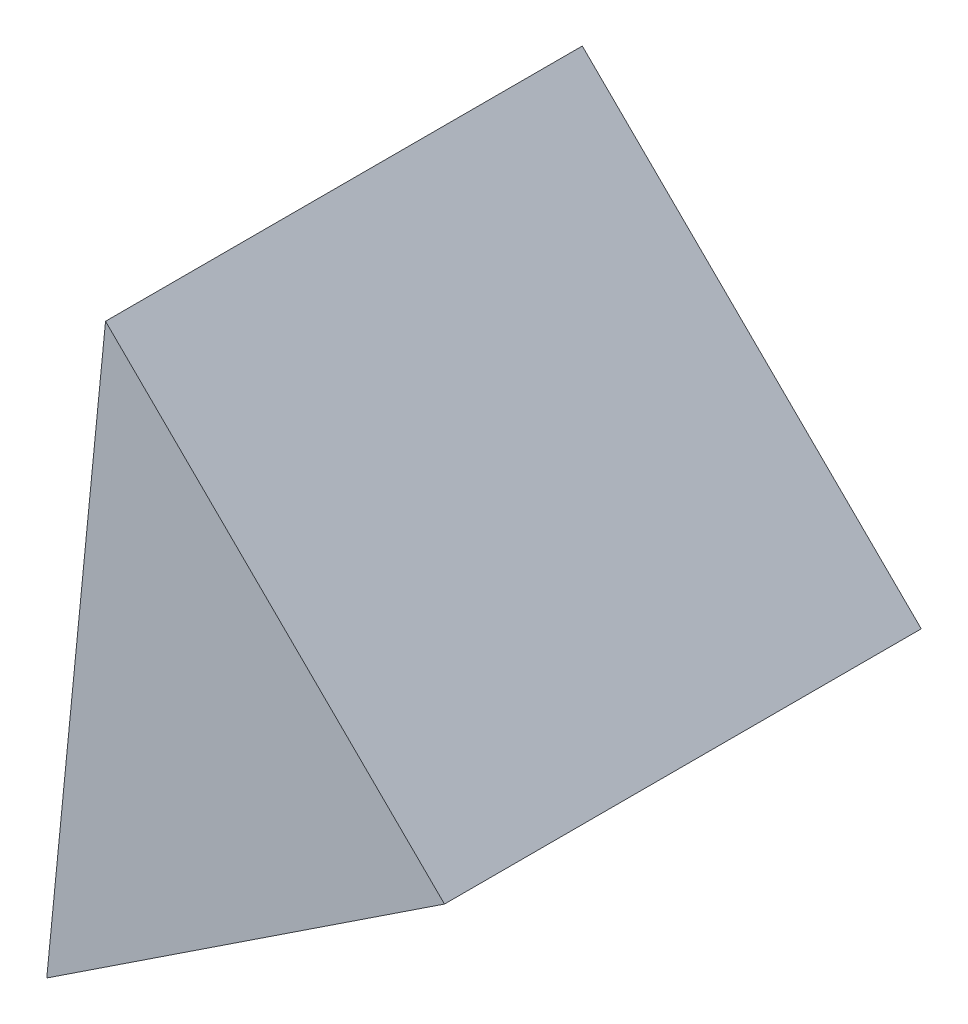
ISO-10303-21;
HEADER;
FILE_DESCRIPTION(('STEP AP214'),'2;1');
FILE_NAME('part.step','',(''),(''),'','','');
FILE_SCHEMA(('AUTOMOTIVE_DESIGN { 1 0 10303 214 1 1 1 1 }'));
ENDSEC;
DATA;
#1=APPLICATION_CONTEXT('core data for automotive mechanical design processes');
#2=APPLICATION_PROTOCOL_DEFINITION('international standard','automotive_design',2000,#1);
#3=PRODUCT_CONTEXT('',#1,'mechanical');
#4=PRODUCT('Part','Part','',(#3));
#5=PRODUCT_RELATED_PRODUCT_CATEGORY('part','',(#4));
#6=PRODUCT_DEFINITION_FORMATION('','',#4);
#7=PRODUCT_DEFINITION_CONTEXT('part definition',#1,'design');
#8=PRODUCT_DEFINITION('design','',#6,#7);
#9=PRODUCT_DEFINITION_SHAPE('','',#8);
#10=(LENGTH_UNIT() NAMED_UNIT(*) SI_UNIT(.MILLI.,.METRE.));
#11=(NAMED_UNIT(*) PLANE_ANGLE_UNIT() SI_UNIT($,.RADIAN.));
#12=(NAMED_UNIT(*) SI_UNIT($,.STERADIAN.) SOLID_ANGLE_UNIT());
#13=UNCERTAINTY_MEASURE_WITH_UNIT(LENGTH_MEASURE(1.E-05),#10,'distance_accuracy_value','');
#14=(GEOMETRIC_REPRESENTATION_CONTEXT(3) GLOBAL_UNCERTAINTY_ASSIGNED_CONTEXT((#13)) GLOBAL_UNIT_ASSIGNED_CONTEXT((#10,
#11,#12)) REPRESENTATION_CONTEXT('',''));
#15=CARTESIAN_POINT('',(0.,0.,0.));
#16=DIRECTION('',(0.,0.,1.));
#17=DIRECTION('',(1.,0.,0.));
#18=AXIS2_PLACEMENT_3D('',#15,#16,#17);
#19=CARTESIAN_POINT('',(9.0285708516963,6.36148636505805,10.));
#20=DIRECTION('',(-0.551401526003401,0.834239987726026,0.));
#21=DIRECTION('',(-0.834239987726026,-0.551401526003401,0.));
#22=AXIS2_PLACEMENT_3D('',#19,#20,#21);
#23=PLANE('',#22);
#24=DIRECTION('',(0.834239987726026,0.551401526003401,0.));
#25=VECTOR('',#24,1.);
#26=CARTESIAN_POINT('',(9.0285708516963,6.36148636505805,0.));
#27=LINE('',#26,#25);
#28=CARTESIAN_POINT('',(0.686170974436035,0.847471105024041,0.));
#29=VERTEX_POINT('',#28);
#30=CARTESIAN_POINT('',(9.0285708516963,6.36148636505805,0.));
#31=VERTEX_POINT('',#30);
#32=EDGE_CURVE('E82',#29,#31,#27,.T.);
#33=ORIENTED_EDGE('',*,*,#32,.T.);
#34=DIRECTION('',(0.,0.,-1.));
#35=VECTOR('',#34,1.);
#36=CARTESIAN_POINT('',(9.0285708516963,6.36148636505805,10.));
#37=LINE('',#36,#35);
#38=CARTESIAN_POINT('',(9.0285708516963,6.36148636505805,10.));
#39=VERTEX_POINT('',#38);
#40=EDGE_CURVE('E11',#39,#31,#37,.T.);
#41=ORIENTED_EDGE('',*,*,#40,.F.);
#42=DIRECTION('',(0.834239987726026,0.551401526003401,0.));
#43=VECTOR('',#42,1.);
#44=CARTESIAN_POINT('',(9.0285708516963,6.36148636505805,10.));
#45=LINE('',#44,#43);
#46=CARTESIAN_POINT('',(0.686170974436035,0.847471105024041,10.));
#47=VERTEX_POINT('',#46);
#48=EDGE_CURVE('E75',#47,#39,#45,.T.);
#49=ORIENTED_EDGE('',*,*,#48,.F.);
#50=DIRECTION('',(0.,0.,-1.));
#51=VECTOR('',#50,1.);
#52=CARTESIAN_POINT('',(0.686170974436035,0.847471105024041,10.));
#53=LINE('',#52,#51);
#54=EDGE_CURVE('E83',#47,#29,#53,.T.);
#55=ORIENTED_EDGE('',*,*,#54,.T.);
#56=EDGE_LOOP('',(#33,#41,#49,#55));
#57=FACE_BOUND('',#56,.T.);
#58=ADVANCED_FACE('F35',(#57),#23,.F.);
#59=CARTESIAN_POINT('',(9.0285708516963,6.36148636505805,10.));
#60=DIRECTION('',(-0.703219485005665,-0.710972823607462,0.));
#61=DIRECTION('',(0.710972823607462,-0.703219485005665,0.));
#62=AXIS2_PLACEMENT_3D('',#59,#60,#61);
#63=PLANE('',#62);
#64=DIRECTION('',(-0.710972823607462,0.703219485005665,0.));
#65=VECTOR('',#64,1.);
#66=CARTESIAN_POINT('',(9.0285708516963,6.36148636505805,0.));
#67=LINE('',#66,#65);
#68=CARTESIAN_POINT('',(1.91884261562168,13.3936812151147,0.));
#69=VERTEX_POINT('',#68);
#70=EDGE_CURVE('E63',#31,#69,#67,.T.);
#71=ORIENTED_EDGE('',*,*,#70,.T.);
#72=DIRECTION('',(0.,0.,-1.));
#73=VECTOR('',#72,1.);
#74=CARTESIAN_POINT('',(1.91884261562168,13.3936812151147,10.));
#75=LINE('',#74,#73);
#76=CARTESIAN_POINT('',(1.91884261562168,13.3936812151147,10.));
#77=VERTEX_POINT('',#76);
#78=EDGE_CURVE('E43',#77,#69,#75,.T.);
#79=ORIENTED_EDGE('',*,*,#78,.F.);
#80=DIRECTION('',(-0.710972823607462,0.703219485005665,0.));
#81=VECTOR('',#80,1.);
#82=CARTESIAN_POINT('',(9.0285708516963,6.36148636505805,10.));
#83=LINE('',#82,#81);
#84=EDGE_CURVE('E71',#39,#77,#83,.T.);
#85=ORIENTED_EDGE('',*,*,#84,.F.);
#86=ORIENTED_EDGE('',*,*,#40,.T.);
#87=EDGE_LOOP('',(#71,#79,#85,#86));
#88=FACE_BOUND('',#87,.T.);
#89=ADVANCED_FACE('F72',(#88),#63,.F.);
#90=CARTESIAN_POINT('',(0.686170974436035,0.847471105024041,10.));
#91=DIRECTION('',(0.995208082962372,-0.0977797095841541,0.));
#92=DIRECTION('',(0.0977797095841541,0.995208082962372,0.));
#93=AXIS2_PLACEMENT_3D('',#90,#91,#92);
#94=PLANE('',#93);
#95=DIRECTION('',(-0.0977797095841541,-0.995208082962372,0.));
#96=VECTOR('',#95,1.);
#97=CARTESIAN_POINT('',(0.686170974436035,0.847471105024041,0.));
#98=LINE('',#97,#96);
#99=EDGE_CURVE('E68',#69,#29,#98,.T.);
#100=ORIENTED_EDGE('',*,*,#99,.T.);
#101=ORIENTED_EDGE('',*,*,#54,.F.);
#102=DIRECTION('',(-0.0977797095841541,-0.995208082962372,0.));
#103=VECTOR('',#102,1.);
#104=CARTESIAN_POINT('',(0.686170974436035,0.847471105024041,10.));
#105=LINE('',#104,#103);
#106=EDGE_CURVE('E51',#77,#47,#105,.T.);
#107=ORIENTED_EDGE('',*,*,#106,.F.);
#108=ORIENTED_EDGE('',*,*,#78,.T.);
#109=EDGE_LOOP('',(#100,#101,#107,#108));
#110=FACE_BOUND('',#109,.T.);
#111=ADVANCED_FACE('F90',(#110),#94,.F.);
#112=CARTESIAN_POINT('',(0.,0.,10.));
#113=DIRECTION('',(0.,0.,-1.));
#114=DIRECTION('',(-1.,0.,0.));
#115=AXIS2_PLACEMENT_3D('',#112,#113,#114);
#116=PLANE('',#115);
#117=ORIENTED_EDGE('',*,*,#48,.T.);
#118=ORIENTED_EDGE('',*,*,#84,.T.);
#119=ORIENTED_EDGE('',*,*,#106,.T.);
#120=EDGE_LOOP('',(#117,#118,#119));
#121=FACE_BOUND('',#120,.T.);
#122=ADVANCED_FACE('F78',(#121),#116,.F.);
#123=CARTESIAN_POINT('',(0.,0.,0.));
#124=DIRECTION('',(0.,0.,-1.));
#125=DIRECTION('',(-1.,0.,0.));
#126=AXIS2_PLACEMENT_3D('',#123,#124,#125);
#127=PLANE('',#126);
#128=ORIENTED_EDGE('',*,*,#32,.F.);
#129=ORIENTED_EDGE('',*,*,#99,.F.);
#130=ORIENTED_EDGE('',*,*,#70,.F.);
#131=EDGE_LOOP('',(#128,#129,#130));
#132=FACE_BOUND('',#131,.T.);
#133=ADVANCED_FACE('F91',(#132),#127,.T.);
#134=CLOSED_SHELL('',(#58,#89,#111,#122,#133));
#135=MANIFOLD_SOLID_BREP('B2',#134);
#136=ADVANCED_BREP_SHAPE_REPRESENTATION('',(#18,#135),#14);
#137=SHAPE_DEFINITION_REPRESENTATION(#9,#136);
ENDSEC;
END-ISO-10303-21;
